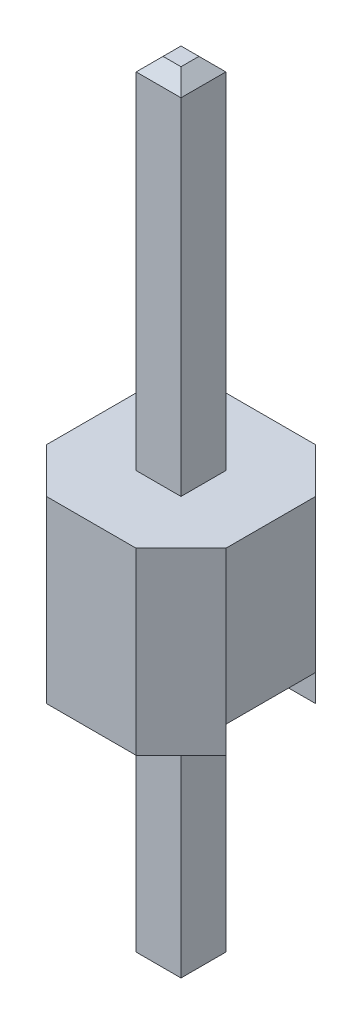
ISO-10303-21;
HEADER;
FILE_DESCRIPTION(('STEP AP214'),'2;1');
FILE_NAME('part.step','',(''),(''),'','','');
FILE_SCHEMA(('AUTOMOTIVE_DESIGN { 1 0 10303 214 1 1 1 1 }'));
ENDSEC;
DATA;
#1=APPLICATION_CONTEXT('core data for automotive mechanical design processes');
#2=APPLICATION_PROTOCOL_DEFINITION('international standard','automotive_design',2000,#1);
#3=PRODUCT_CONTEXT('',#1,'mechanical');
#4=PRODUCT('Part','Part','',(#3));
#5=PRODUCT_RELATED_PRODUCT_CATEGORY('part','',(#4));
#6=PRODUCT_DEFINITION_FORMATION('','',#4);
#7=PRODUCT_DEFINITION_CONTEXT('part definition',#1,'design');
#8=PRODUCT_DEFINITION('design','',#6,#7);
#9=PRODUCT_DEFINITION_SHAPE('','',#8);
#10=(LENGTH_UNIT() NAMED_UNIT(*) SI_UNIT(.MILLI.,.METRE.));
#11=(NAMED_UNIT(*) PLANE_ANGLE_UNIT() SI_UNIT($,.RADIAN.));
#12=(NAMED_UNIT(*) SI_UNIT($,.STERADIAN.) SOLID_ANGLE_UNIT());
#13=UNCERTAINTY_MEASURE_WITH_UNIT(LENGTH_MEASURE(1.E-05),#10,'distance_accuracy_value','');
#14=(GEOMETRIC_REPRESENTATION_CONTEXT(3) GLOBAL_UNCERTAINTY_ASSIGNED_CONTEXT((#13)) GLOBAL_UNIT_ASSIGNED_CONTEXT((#10,
#11,#12)) REPRESENTATION_CONTEXT('',''));
#15=CARTESIAN_POINT('',(0.,0.,0.));
#16=DIRECTION('',(0.,0.,1.));
#17=DIRECTION('',(1.,0.,0.));
#18=AXIS2_PLACEMENT_3D('',#15,#16,#17);
#19=CARTESIAN_POINT('',(-2.59591892663164,0.381,0.634999999999996));
#20=DIRECTION('',(0.,1.,0.));
#21=DIRECTION('',(0.,0.,1.));
#22=AXIS2_PLACEMENT_3D('',#19,#20,#21);
#23=PLANE('',#22);
#24=DIRECTION('',(0.,0.,-1.));
#25=VECTOR('',#24,1.);
#26=CARTESIAN_POINT('',(-1.27,0.381,0.635000000000008));
#27=LINE('',#26,#25);
#28=CARTESIAN_POINT('',(-1.27,0.381,0.634999999999998));
#29=VERTEX_POINT('',#28);
#30=CARTESIAN_POINT('',(-1.26999999999999,0.381,-0.635000000000004));
#31=VERTEX_POINT('',#30);
#32=EDGE_CURVE('E241',#29,#31,#27,.T.);
#33=ORIENTED_EDGE('',*,*,#32,.T.);
#34=DIRECTION('',(1.,0.,0.));
#35=VECTOR('',#34,1.);
#36=CARTESIAN_POINT('',(-2.59591892663164,0.381,-0.635000000000004));
#37=LINE('',#36,#35);
#38=CARTESIAN_POINT('',(1.27,0.381,-0.634999999999998));
#39=VERTEX_POINT('',#38);
#40=EDGE_CURVE('E249',#31,#39,#37,.T.);
#41=ORIENTED_EDGE('',*,*,#40,.T.);
#42=DIRECTION('',(0.,0.,1.));
#43=VECTOR('',#42,1.);
#44=CARTESIAN_POINT('',(1.27,0.381,0.635000000000002));
#45=LINE('',#44,#43);
#46=CARTESIAN_POINT('',(1.27,0.381,0.635000000000002));
#47=VERTEX_POINT('',#46);
#48=EDGE_CURVE('E244',#39,#47,#45,.T.);
#49=ORIENTED_EDGE('',*,*,#48,.T.);
#50=DIRECTION('',(1.,0.,0.));
#51=VECTOR('',#50,1.);
#52=CARTESIAN_POINT('',(-2.59591892663164,0.381,0.634999999999996));
#53=LINE('',#52,#51);
#54=EDGE_CURVE('E254',#29,#47,#53,.T.);
#55=ORIENTED_EDGE('',*,*,#54,.F.);
#56=EDGE_LOOP('',(#33,#41,#49,#55));
#57=FACE_BOUND('',#56,.T.);
#58=DIRECTION('',(0.,0.,1.));
#59=VECTOR('',#58,1.);
#60=CARTESIAN_POINT('',(0.3175,0.381,-0.3175));
#61=LINE('',#60,#59);
#62=CARTESIAN_POINT('',(0.3175,0.381,-0.3175));
#63=VERTEX_POINT('',#62);
#64=CARTESIAN_POINT('',(0.3175,0.381,0.3175));
#65=VERTEX_POINT('',#64);
#66=EDGE_CURVE('E186',#63,#65,#61,.T.);
#67=ORIENTED_EDGE('',*,*,#66,.F.);
#68=DIRECTION('',(1.,0.,0.));
#69=VECTOR('',#68,1.);
#70=CARTESIAN_POINT('',(-0.3175,0.381,-0.3175));
#71=LINE('',#70,#69);
#72=CARTESIAN_POINT('',(-0.3175,0.381,-0.3175));
#73=VERTEX_POINT('',#72);
#74=EDGE_CURVE('E191',#73,#63,#71,.T.);
#75=ORIENTED_EDGE('',*,*,#74,.F.);
#76=DIRECTION('',(0.,0.,-1.));
#77=VECTOR('',#76,1.);
#78=CARTESIAN_POINT('',(-0.3175,0.381,-0.3175));
#79=LINE('',#78,#77);
#80=CARTESIAN_POINT('',(-0.3175,0.381,0.3175));
#81=VERTEX_POINT('',#80);
#82=EDGE_CURVE('E203',#81,#73,#79,.T.);
#83=ORIENTED_EDGE('',*,*,#82,.F.);
#84=DIRECTION('',(-1.,0.,0.));
#85=VECTOR('',#84,1.);
#86=CARTESIAN_POINT('',(-0.3175,0.381,0.3175));
#87=LINE('',#86,#85);
#88=EDGE_CURVE('E199',#65,#81,#87,.T.);
#89=ORIENTED_EDGE('',*,*,#88,.F.);
#90=EDGE_LOOP('',(#67,#75,#83,#89));
#91=FACE_BOUND('',#90,.T.);
#92=ADVANCED_FACE('F36',(#57,#91),#23,.F.);
#93=CARTESIAN_POINT('',(0.,2.54,0.));
#94=DIRECTION('',(0.,1.,0.));
#95=DIRECTION('',(0.,0.,1.));
#96=AXIS2_PLACEMENT_3D('',#93,#94,#95);
#97=PLANE('',#96);
#98=DIRECTION('',(-1.,0.,0.));
#99=VECTOR('',#98,1.);
#100=CARTESIAN_POINT('',(-0.634999999999986,2.54,-1.27000000000001));
#101=LINE('',#100,#99);
#102=CARTESIAN_POINT('',(0.634999999999999,2.54,-1.27));
#103=VERTEX_POINT('',#102);
#104=CARTESIAN_POINT('',(-0.634999999999986,2.54,-1.27000000000001));
#105=VERTEX_POINT('',#104);
#106=EDGE_CURVE('E259',#103,#105,#101,.T.);
#107=ORIENTED_EDGE('',*,*,#106,.T.);
#108=DIRECTION('',(-0.707106781186555,0.,0.70710678118654));
#109=VECTOR('',#108,1.);
#110=CARTESIAN_POINT('',(-1.26999999999999,2.54,-0.635000000000013));
#111=LINE('',#110,#109);
#112=CARTESIAN_POINT('',(-1.26999999999999,2.54,-0.635000000000013));
#113=VERTEX_POINT('',#112);
#114=EDGE_CURVE('E262',#105,#113,#111,.T.);
#115=ORIENTED_EDGE('',*,*,#114,.T.);
#116=DIRECTION('',(0.,0.,1.));
#117=VECTOR('',#116,1.);
#118=CARTESIAN_POINT('',(-1.27,2.54,0.63499999999999));
#119=LINE('',#118,#117);
#120=CARTESIAN_POINT('',(-1.27,2.54,0.63499999999999));
#121=VERTEX_POINT('',#120);
#122=EDGE_CURVE('E265',#113,#121,#119,.T.);
#123=ORIENTED_EDGE('',*,*,#122,.T.);
#124=DIRECTION('',(0.707106781186542,0.,0.707106781186553));
#125=VECTOR('',#124,1.);
#126=CARTESIAN_POINT('',(-0.635000000000008,2.54,1.27));
#127=LINE('',#126,#125);
#128=CARTESIAN_POINT('',(-0.635000000000008,2.54,1.27));
#129=VERTEX_POINT('',#128);
#130=EDGE_CURVE('E267',#121,#129,#127,.T.);
#131=ORIENTED_EDGE('',*,*,#130,.T.);
#132=DIRECTION('',(1.,0.,0.));
#133=VECTOR('',#132,1.);
#134=CARTESIAN_POINT('',(-0.635000000000008,2.54,1.27));
#135=LINE('',#134,#133);
#136=CARTESIAN_POINT('',(0.634999999999995,2.54,1.27));
#137=VERTEX_POINT('',#136);
#138=EDGE_CURVE('E269',#129,#137,#135,.T.);
#139=ORIENTED_EDGE('',*,*,#138,.T.);
#140=DIRECTION('',(0.70710678118655,0.,-0.707106781186545));
#141=VECTOR('',#140,1.);
#142=CARTESIAN_POINT('',(1.27,2.54,0.635000000000004));
#143=LINE('',#142,#141);
#144=CARTESIAN_POINT('',(1.27,2.54,0.635000000000004));
#145=VERTEX_POINT('',#144);
#146=EDGE_CURVE('E271',#137,#145,#143,.T.);
#147=ORIENTED_EDGE('',*,*,#146,.T.);
#148=DIRECTION('',(0.,0.,-1.));
#149=VECTOR('',#148,1.);
#150=CARTESIAN_POINT('',(1.27,2.54,0.635000000000004));
#151=LINE('',#150,#149);
#152=CARTESIAN_POINT('',(1.27,2.54,-0.634999999999999));
#153=VERTEX_POINT('',#152);
#154=EDGE_CURVE('E273',#145,#153,#151,.T.);
#155=ORIENTED_EDGE('',*,*,#154,.T.);
#156=DIRECTION('',(-0.707106781186548,0.,-0.707106781186548));
#157=VECTOR('',#156,1.);
#158=CARTESIAN_POINT('',(0.634999999999999,2.54,-1.27));
#159=LINE('',#158,#157);
#160=EDGE_CURVE('E275',#153,#103,#159,.T.);
#161=ORIENTED_EDGE('',*,*,#160,.T.);
#162=EDGE_LOOP('',(#107,#115,#123,#131,#139,#147,#155,#161));
#163=FACE_BOUND('',#162,.T.);
#164=DIRECTION('',(-1.,0.,0.));
#165=VECTOR('',#164,1.);
#166=CARTESIAN_POINT('',(-0.3175,2.54,-0.3175));
#167=LINE('',#166,#165);
#168=CARTESIAN_POINT('',(0.3175,2.54,-0.3175));
#169=VERTEX_POINT('',#168);
#170=CARTESIAN_POINT('',(-0.3175,2.54,-0.3175));
#171=VERTEX_POINT('',#170);
#172=EDGE_CURVE('E217',#169,#171,#167,.T.);
#173=ORIENTED_EDGE('',*,*,#172,.F.);
#174=DIRECTION('',(0.,0.,-1.));
#175=VECTOR('',#174,1.);
#176=CARTESIAN_POINT('',(0.3175,2.54,0.3175));
#177=LINE('',#176,#175);
#178=CARTESIAN_POINT('',(0.3175,2.54,0.3175));
#179=VERTEX_POINT('',#178);
#180=EDGE_CURVE('E214',#179,#169,#177,.T.);
#181=ORIENTED_EDGE('',*,*,#180,.F.);
#182=DIRECTION('',(1.,0.,0.));
#183=VECTOR('',#182,1.);
#184=CARTESIAN_POINT('',(-0.3175,2.54,0.3175));
#185=LINE('',#184,#183);
#186=CARTESIAN_POINT('',(-0.3175,2.54,0.3175));
#187=VERTEX_POINT('',#186);
#188=EDGE_CURVE('E224',#187,#179,#185,.T.);
#189=ORIENTED_EDGE('',*,*,#188,.F.);
#190=DIRECTION('',(0.,0.,1.));
#191=VECTOR('',#190,1.);
#192=CARTESIAN_POINT('',(-0.3175,2.54,0.3175));
#193=LINE('',#192,#191);
#194=EDGE_CURVE('E221',#171,#187,#193,.T.);
#195=ORIENTED_EDGE('',*,*,#194,.F.);
#196=EDGE_LOOP('',(#173,#181,#189,#195));
#197=FACE_BOUND('',#196,.T.);
#198=ADVANCED_FACE('F389',(#163,#197),#97,.T.);
#199=CARTESIAN_POINT('',(0.,0.,0.));
#200=DIRECTION('',(0.,1.,0.));
#201=DIRECTION('',(0.,0.,1.));
#202=AXIS2_PLACEMENT_3D('',#199,#200,#201);
#203=PLANE('',#202);
#204=DIRECTION('',(-0.707106781186548,0.,-0.707106781186548));
#205=VECTOR('',#204,1.);
#206=CARTESIAN_POINT('',(0.634999999999999,0.,-1.27));
#207=LINE('',#206,#205);
#208=CARTESIAN_POINT('',(1.27,0.,-0.634999999999999));
#209=VERTEX_POINT('',#208);
#210=CARTESIAN_POINT('',(0.634999999999999,0.,-1.27));
#211=VERTEX_POINT('',#210);
#212=EDGE_CURVE('E263',#209,#211,#207,.T.);
#213=ORIENTED_EDGE('',*,*,#212,.F.);
#214=DIRECTION('',(1.,0.,0.));
#215=VECTOR('',#214,1.);
#216=CARTESIAN_POINT('',(-2.59591892663164,0.,-0.635000000000005));
#217=LINE('',#216,#215);
#218=CARTESIAN_POINT('',(-1.26999999999999,0.,-0.635000000000006));
#219=VERTEX_POINT('',#218);
#220=EDGE_CURVE('E239',#219,#209,#217,.T.);
#221=ORIENTED_EDGE('',*,*,#220,.F.);
#222=DIRECTION('',(-0.707106781186555,0.,0.70710678118654));
#223=VECTOR('',#222,1.);
#224=CARTESIAN_POINT('',(-1.26999999999999,0.,-0.635000000000013));
#225=LINE('',#224,#223);
#226=CARTESIAN_POINT('',(-0.634999999999986,0.,-1.27000000000001));
#227=VERTEX_POINT('',#226);
#228=EDGE_CURVE('E280',#227,#219,#225,.T.);
#229=ORIENTED_EDGE('',*,*,#228,.F.);
#230=DIRECTION('',(-1.,0.,0.));
#231=VECTOR('',#230,1.);
#232=CARTESIAN_POINT('',(-0.634999999999986,0.,-1.27000000000001));
#233=LINE('',#232,#231);
#234=EDGE_CURVE('E258',#211,#227,#233,.T.);
#235=ORIENTED_EDGE('',*,*,#234,.F.);
#236=EDGE_LOOP('',(#213,#221,#229,#235));
#237=FACE_BOUND('',#236,.T.);
#238=ADVANCED_FACE('F395',(#237),#203,.F.);
#239=CARTESIAN_POINT('',(-0.634999999999986,2.54,-1.27000000000001));
#240=DIRECTION('',(0.,0.,1.));
#241=DIRECTION('',(1.,0.,0.));
#242=AXIS2_PLACEMENT_3D('',#239,#240,#241);
#243=PLANE('',#242);
#244=ORIENTED_EDGE('',*,*,#234,.T.);
#245=DIRECTION('',(0.,-1.,0.));
#246=VECTOR('',#245,1.);
#247=CARTESIAN_POINT('',(-0.634999999999986,2.54,-1.27000000000001));
#248=LINE('',#247,#246);
#249=EDGE_CURVE('E311',#105,#227,#248,.T.);
#250=ORIENTED_EDGE('',*,*,#249,.F.);
#251=ORIENTED_EDGE('',*,*,#106,.F.);
#252=DIRECTION('',(0.,-1.,0.));
#253=VECTOR('',#252,1.);
#254=CARTESIAN_POINT('',(0.634999999999999,2.54,-1.27));
#255=LINE('',#254,#253);
#256=EDGE_CURVE('E277',#103,#211,#255,.T.);
#257=ORIENTED_EDGE('',*,*,#256,.T.);
#258=EDGE_LOOP('',(#244,#250,#251,#257));
#259=FACE_BOUND('',#258,.T.);
#260=ADVANCED_FACE('F437',(#259),#243,.F.);
#261=CARTESIAN_POINT('',(-1.26999999999999,2.54,-0.635000000000013));
#262=DIRECTION('',(0.70710678118654,0.,0.707106781186555));
#263=DIRECTION('',(0.707106781186555,0.,-0.70710678118654));
#264=AXIS2_PLACEMENT_3D('',#261,#262,#263);
#265=PLANE('',#264);
#266=ORIENTED_EDGE('',*,*,#228,.T.);
#267=DIRECTION('',(0.,-1.,0.));
#268=VECTOR('',#267,1.);
#269=CARTESIAN_POINT('',(-1.26999999999999,0.,-0.635000000000003));
#270=LINE('',#269,#268);
#271=EDGE_CURVE('E238',#31,#219,#270,.T.);
#272=ORIENTED_EDGE('',*,*,#271,.F.);
#273=DIRECTION('',(0.,-1.,0.));
#274=VECTOR('',#273,1.);
#275=CARTESIAN_POINT('',(-1.26999999999999,2.54,-0.635000000000013));
#276=LINE('',#275,#274);
#277=EDGE_CURVE('E308',#113,#31,#276,.T.);
#278=ORIENTED_EDGE('',*,*,#277,.F.);
#279=ORIENTED_EDGE('',*,*,#114,.F.);
#280=ORIENTED_EDGE('',*,*,#249,.T.);
#281=EDGE_LOOP('',(#266,#272,#278,#279,#280));
#282=FACE_BOUND('',#281,.T.);
#283=ADVANCED_FACE('F433',(#282),#265,.F.);
#284=CARTESIAN_POINT('',(-1.27,2.54,0.63499999999999));
#285=DIRECTION('',(1.,0.,0.));
#286=DIRECTION('',(0.,0.,-1.));
#287=AXIS2_PLACEMENT_3D('',#284,#285,#286);
#288=PLANE('',#287);
#289=ORIENTED_EDGE('',*,*,#277,.T.);
#290=ORIENTED_EDGE('',*,*,#32,.F.);
#291=DIRECTION('',(0.,-1.,0.));
#292=VECTOR('',#291,1.);
#293=CARTESIAN_POINT('',(-1.27,2.54,0.63499999999999));
#294=LINE('',#293,#292);
#295=EDGE_CURVE('E305',#121,#29,#294,.T.);
#296=ORIENTED_EDGE('',*,*,#295,.F.);
#297=ORIENTED_EDGE('',*,*,#122,.F.);
#298=EDGE_LOOP('',(#289,#290,#296,#297));
#299=FACE_BOUND('',#298,.T.);
#300=ADVANCED_FACE('F429',(#299),#288,.F.);
#301=CARTESIAN_POINT('',(-0.635000000000008,2.54,1.27));
#302=DIRECTION('',(0.707106781186553,0.,-0.707106781186542));
#303=DIRECTION('',(-0.707106781186542,0.,-0.707106781186553));
#304=AXIS2_PLACEMENT_3D('',#301,#302,#303);
#305=PLANE('',#304);
#306=DIRECTION('',(0.707106781186542,0.,0.707106781186553));
#307=VECTOR('',#306,1.);
#308=CARTESIAN_POINT('',(-0.635000000000008,0.,1.27));
#309=LINE('',#308,#307);
#310=CARTESIAN_POINT('',(-1.27,0.,0.635));
#311=VERTEX_POINT('',#310);
#312=CARTESIAN_POINT('',(-0.635000000000008,0.,1.27));
#313=VERTEX_POINT('',#312);
#314=EDGE_CURVE('E283',#311,#313,#309,.T.);
#315=ORIENTED_EDGE('',*,*,#314,.T.);
#316=DIRECTION('',(0.,-1.,0.));
#317=VECTOR('',#316,1.);
#318=CARTESIAN_POINT('',(-0.635000000000008,2.54,1.27));
#319=LINE('',#318,#317);
#320=EDGE_CURVE('E302',#129,#313,#319,.T.);
#321=ORIENTED_EDGE('',*,*,#320,.F.);
#322=ORIENTED_EDGE('',*,*,#130,.F.);
#323=ORIENTED_EDGE('',*,*,#295,.T.);
#324=DIRECTION('',(0.,1.,0.));
#325=VECTOR('',#324,1.);
#326=CARTESIAN_POINT('',(-1.27,0.,0.635));
#327=LINE('',#326,#325);
#328=EDGE_CURVE('E236',#311,#29,#327,.T.);
#329=ORIENTED_EDGE('',*,*,#328,.F.);
#330=EDGE_LOOP('',(#315,#321,#322,#323,#329));
#331=FACE_BOUND('',#330,.T.);
#332=ADVANCED_FACE('F425',(#331),#305,.F.);
#333=CARTESIAN_POINT('',(-0.635000000000008,2.54,1.27));
#334=DIRECTION('',(0.,0.,-1.));
#335=DIRECTION('',(-1.,0.,0.));
#336=AXIS2_PLACEMENT_3D('',#333,#334,#335);
#337=PLANE('',#336);
#338=DIRECTION('',(1.,0.,0.));
#339=VECTOR('',#338,1.);
#340=CARTESIAN_POINT('',(-0.635000000000008,0.,1.27));
#341=LINE('',#340,#339);
#342=CARTESIAN_POINT('',(0.634999999999995,0.,1.27));
#343=VERTEX_POINT('',#342);
#344=EDGE_CURVE('E285',#313,#343,#341,.T.);
#345=ORIENTED_EDGE('',*,*,#344,.T.);
#346=DIRECTION('',(0.,-1.,0.));
#347=VECTOR('',#346,1.);
#348=CARTESIAN_POINT('',(0.634999999999995,2.54,1.27));
#349=LINE('',#348,#347);
#350=EDGE_CURVE('E299',#137,#343,#349,.T.);
#351=ORIENTED_EDGE('',*,*,#350,.F.);
#352=ORIENTED_EDGE('',*,*,#138,.F.);
#353=ORIENTED_EDGE('',*,*,#320,.T.);
#354=EDGE_LOOP('',(#345,#351,#352,#353));
#355=FACE_BOUND('',#354,.T.);
#356=ADVANCED_FACE('F421',(#355),#337,.F.);
#357=CARTESIAN_POINT('',(1.27,2.54,0.635000000000004));
#358=DIRECTION('',(-0.707106781186545,0.,-0.70710678118655));
#359=DIRECTION('',(-0.70710678118655,0.,0.707106781186545));
#360=AXIS2_PLACEMENT_3D('',#357,#358,#359);
#361=PLANE('',#360);
#362=DIRECTION('',(0.70710678118655,0.,-0.707106781186545));
#363=VECTOR('',#362,1.);
#364=CARTESIAN_POINT('',(1.27,0.,0.635000000000004));
#365=LINE('',#364,#363);
#366=CARTESIAN_POINT('',(1.27,0.,0.635000000000004));
#367=VERTEX_POINT('',#366);
#368=EDGE_CURVE('E287',#343,#367,#365,.T.);
#369=ORIENTED_EDGE('',*,*,#368,.T.);
#370=DIRECTION('',(0.,-1.,0.));
#371=VECTOR('',#370,1.);
#372=CARTESIAN_POINT('',(1.27,0.,0.635000000000004));
#373=LINE('',#372,#371);
#374=EDGE_CURVE('E247',#47,#367,#373,.T.);
#375=ORIENTED_EDGE('',*,*,#374,.F.);
#376=DIRECTION('',(0.,-1.,0.));
#377=VECTOR('',#376,1.);
#378=CARTESIAN_POINT('',(1.27,2.54,0.635000000000004));
#379=LINE('',#378,#377);
#380=EDGE_CURVE('E296',#145,#47,#379,.T.);
#381=ORIENTED_EDGE('',*,*,#380,.F.);
#382=ORIENTED_EDGE('',*,*,#146,.F.);
#383=ORIENTED_EDGE('',*,*,#350,.T.);
#384=EDGE_LOOP('',(#369,#375,#381,#382,#383));
#385=FACE_BOUND('',#384,.T.);
#386=ADVANCED_FACE('F417',(#385),#361,.F.);
#387=CARTESIAN_POINT('',(1.27,2.54,0.635000000000004));
#388=DIRECTION('',(-1.,0.,0.));
#389=DIRECTION('',(0.,0.,1.));
#390=AXIS2_PLACEMENT_3D('',#387,#388,#389);
#391=PLANE('',#390);
#392=ORIENTED_EDGE('',*,*,#380,.T.);
#393=ORIENTED_EDGE('',*,*,#48,.F.);
#394=DIRECTION('',(0.,-1.,0.));
#395=VECTOR('',#394,1.);
#396=CARTESIAN_POINT('',(1.27,2.54,-0.634999999999999));
#397=LINE('',#396,#395);
#398=EDGE_CURVE('E293',#153,#39,#397,.T.);
#399=ORIENTED_EDGE('',*,*,#398,.F.);
#400=ORIENTED_EDGE('',*,*,#154,.F.);
#401=EDGE_LOOP('',(#392,#393,#399,#400));
#402=FACE_BOUND('',#401,.T.);
#403=ADVANCED_FACE('F413',(#402),#391,.F.);
#404=CARTESIAN_POINT('',(0.634999999999999,2.54,-1.27));
#405=DIRECTION('',(-0.707106781186548,0.,0.707106781186548));
#406=DIRECTION('',(0.707106781186548,0.,0.707106781186548));
#407=AXIS2_PLACEMENT_3D('',#404,#405,#406);
#408=PLANE('',#407);
#409=ORIENTED_EDGE('',*,*,#212,.T.);
#410=ORIENTED_EDGE('',*,*,#256,.F.);
#411=ORIENTED_EDGE('',*,*,#160,.F.);
#412=ORIENTED_EDGE('',*,*,#398,.T.);
#413=DIRECTION('',(0.,1.,0.));
#414=VECTOR('',#413,1.);
#415=CARTESIAN_POINT('',(1.27,0.,-0.634999999999999));
#416=LINE('',#415,#414);
#417=EDGE_CURVE('E235',#209,#39,#416,.T.);
#418=ORIENTED_EDGE('',*,*,#417,.F.);
#419=EDGE_LOOP('',(#409,#410,#411,#412,#418));
#420=FACE_BOUND('',#419,.T.);
#421=ADVANCED_FACE('F409',(#420),#408,.F.);
#422=ORIENTED_EDGE('',*,*,#314,.F.);
#423=DIRECTION('',(1.,0.,0.));
#424=VECTOR('',#423,1.);
#425=CARTESIAN_POINT('',(-2.59591892663164,0.,0.634999999999998));
#426=LINE('',#425,#424);
#427=EDGE_CURVE('E251',#311,#367,#426,.T.);
#428=ORIENTED_EDGE('',*,*,#427,.T.);
#429=ORIENTED_EDGE('',*,*,#368,.F.);
#430=ORIENTED_EDGE('',*,*,#344,.F.);
#431=EDGE_LOOP('',(#422,#428,#429,#430));
#432=FACE_BOUND('',#431,.T.);
#433=ADVANCED_FACE('F404',(#432),#203,.F.);
#434=CARTESIAN_POINT('',(-2.59591892663164,0.,-0.635000000000005));
#435=DIRECTION('',(0.,0.,-1.));
#436=DIRECTION('',(0.,1.,0.));
#437=AXIS2_PLACEMENT_3D('',#434,#435,#436);
#438=PLANE('',#437);
#439=ORIENTED_EDGE('',*,*,#271,.T.);
#440=ORIENTED_EDGE('',*,*,#220,.T.);
#441=ORIENTED_EDGE('',*,*,#417,.T.);
#442=ORIENTED_EDGE('',*,*,#40,.F.);
#443=EDGE_LOOP('',(#439,#440,#441,#442));
#444=FACE_BOUND('',#443,.T.);
#445=ADVANCED_FACE('F402',(#444),#438,.F.);
#446=CARTESIAN_POINT('',(-2.59591892663164,0.,0.634999999999998));
#447=DIRECTION('',(0.,0.,1.));
#448=DIRECTION('',(0.,-1.,0.));
#449=AXIS2_PLACEMENT_3D('',#446,#447,#448);
#450=PLANE('',#449);
#451=ORIENTED_EDGE('',*,*,#328,.T.);
#452=ORIENTED_EDGE('',*,*,#54,.T.);
#453=ORIENTED_EDGE('',*,*,#374,.T.);
#454=ORIENTED_EDGE('',*,*,#427,.F.);
#455=EDGE_LOOP('',(#451,#452,#453,#454));
#456=FACE_BOUND('',#455,.T.);
#457=ADVANCED_FACE('F400',(#456),#450,.F.);
#458=CARTESIAN_POINT('',(0.3175,7.62,0.3175));
#459=DIRECTION('',(-1.,0.,0.));
#460=DIRECTION('',(0.,0.,1.));
#461=AXIS2_PLACEMENT_3D('',#458,#459,#460);
#462=PLANE('',#461);
#463=DIRECTION('',(0.,-1.,0.));
#464=VECTOR('',#463,1.);
#465=CARTESIAN_POINT('',(0.3175,7.62,-0.3175));
#466=LINE('',#465,#464);
#467=CARTESIAN_POINT('',(0.3175,7.4295,-0.3175));
#468=VERTEX_POINT('',#467);
#469=EDGE_CURVE('E233',#468,#169,#466,.T.);
#470=ORIENTED_EDGE('',*,*,#469,.F.);
#471=DIRECTION('',(0.,0.,1.));
#472=VECTOR('',#471,1.);
#473=CARTESIAN_POINT('',(0.3175,7.4295,0.3175));
#474=LINE('',#473,#472);
#475=CARTESIAN_POINT('',(0.3175,7.4295,0.3175));
#476=VERTEX_POINT('',#475);
#477=EDGE_CURVE('E326',#468,#476,#474,.T.);
#478=ORIENTED_EDGE('',*,*,#477,.T.);
#479=DIRECTION('',(0.,-1.,0.));
#480=VECTOR('',#479,1.);
#481=CARTESIAN_POINT('',(0.3175,7.62,0.3175));
#482=LINE('',#481,#480);
#483=EDGE_CURVE('E227',#476,#179,#482,.T.);
#484=ORIENTED_EDGE('',*,*,#483,.T.);
#485=ORIENTED_EDGE('',*,*,#180,.T.);
#486=EDGE_LOOP('',(#470,#478,#484,#485));
#487=FACE_BOUND('',#486,.T.);
#488=ADVANCED_FACE('F526',(#487),#462,.F.);
#489=CARTESIAN_POINT('',(-0.3175,7.62,-0.3175));
#490=DIRECTION('',(0.,0.,1.));
#491=DIRECTION('',(1.,0.,0.));
#492=AXIS2_PLACEMENT_3D('',#489,#490,#491);
#493=PLANE('',#492);
#494=DIRECTION('',(0.,-1.,0.));
#495=VECTOR('',#494,1.);
#496=CARTESIAN_POINT('',(-0.3175,7.62,-0.3175));
#497=LINE('',#496,#495);
#498=CARTESIAN_POINT('',(-0.3175,7.4295,-0.3175));
#499=VERTEX_POINT('',#498);
#500=EDGE_CURVE('E231',#499,#171,#497,.T.);
#501=ORIENTED_EDGE('',*,*,#500,.F.);
#502=DIRECTION('',(1.,0.,0.));
#503=VECTOR('',#502,1.);
#504=CARTESIAN_POINT('',(-0.3175,7.4295,-0.3175));
#505=LINE('',#504,#503);
#506=EDGE_CURVE('E323',#499,#468,#505,.T.);
#507=ORIENTED_EDGE('',*,*,#506,.T.);
#508=ORIENTED_EDGE('',*,*,#469,.T.);
#509=ORIENTED_EDGE('',*,*,#172,.T.);
#510=EDGE_LOOP('',(#501,#507,#508,#509));
#511=FACE_BOUND('',#510,.T.);
#512=ADVANCED_FACE('F514',(#511),#493,.F.);
#513=CARTESIAN_POINT('',(-0.3175,7.62,0.3175));
#514=DIRECTION('',(1.,0.,0.));
#515=DIRECTION('',(0.,0.,-1.));
#516=AXIS2_PLACEMENT_3D('',#513,#514,#515);
#517=PLANE('',#516);
#518=DIRECTION('',(0.,-1.,0.));
#519=VECTOR('',#518,1.);
#520=CARTESIAN_POINT('',(-0.3175,7.62,0.3175));
#521=LINE('',#520,#519);
#522=CARTESIAN_POINT('',(-0.3175,7.4295,0.3175));
#523=VERTEX_POINT('',#522);
#524=EDGE_CURVE('E229',#523,#187,#521,.T.);
#525=ORIENTED_EDGE('',*,*,#524,.F.);
#526=DIRECTION('',(0.,0.,-1.));
#527=VECTOR('',#526,1.);
#528=CARTESIAN_POINT('',(-0.3175,7.4295,0.3175));
#529=LINE('',#528,#527);
#530=EDGE_CURVE('E328',#523,#499,#529,.T.);
#531=ORIENTED_EDGE('',*,*,#530,.T.);
#532=ORIENTED_EDGE('',*,*,#500,.T.);
#533=ORIENTED_EDGE('',*,*,#194,.T.);
#534=EDGE_LOOP('',(#525,#531,#532,#533));
#535=FACE_BOUND('',#534,.T.);
#536=ADVANCED_FACE('F508',(#535),#517,.F.);
#537=CARTESIAN_POINT('',(-0.3175,7.62,0.3175));
#538=DIRECTION('',(0.,0.,-1.));
#539=DIRECTION('',(-1.,0.,0.));
#540=AXIS2_PLACEMENT_3D('',#537,#538,#539);
#541=PLANE('',#540);
#542=ORIENTED_EDGE('',*,*,#483,.F.);
#543=DIRECTION('',(-1.,0.,0.));
#544=VECTOR('',#543,1.);
#545=CARTESIAN_POINT('',(-0.3175,7.4295,0.3175));
#546=LINE('',#545,#544);
#547=EDGE_CURVE('E330',#476,#523,#546,.T.);
#548=ORIENTED_EDGE('',*,*,#547,.T.);
#549=ORIENTED_EDGE('',*,*,#524,.T.);
#550=ORIENTED_EDGE('',*,*,#188,.T.);
#551=EDGE_LOOP('',(#542,#548,#549,#550));
#552=FACE_BOUND('',#551,.T.);
#553=ADVANCED_FACE('F513',(#552),#541,.F.);
#554=CARTESIAN_POINT('',(0.,7.62,0.));
#555=DIRECTION('',(0.,-1.,0.));
#556=DIRECTION('',(0.,0.,-1.));
#557=AXIS2_PLACEMENT_3D('',#554,#555,#556);
#558=PLANE('',#557);
#559=DIRECTION('',(0.,0.,-1.));
#560=VECTOR('',#559,1.);
#561=CARTESIAN_POINT('',(0.127000000000001,7.62,0.));
#562=LINE('',#561,#560);
#563=CARTESIAN_POINT('',(0.127000000000001,7.62,0.127000000000001));
#564=VERTEX_POINT('',#563);
#565=CARTESIAN_POINT('',(0.127000000000001,7.62,-0.127000000000001));
#566=VERTEX_POINT('',#565);
#567=EDGE_CURVE('E318',#564,#566,#562,.T.);
#568=ORIENTED_EDGE('',*,*,#567,.T.);
#569=DIRECTION('',(-1.,0.,0.));
#570=VECTOR('',#569,1.);
#571=CARTESIAN_POINT('',(0.,7.62,-0.127000000000001));
#572=LINE('',#571,#570);
#573=CARTESIAN_POINT('',(-0.127000000000001,7.62,-0.127000000000001));
#574=VERTEX_POINT('',#573);
#575=EDGE_CURVE('E320',#566,#574,#572,.T.);
#576=ORIENTED_EDGE('',*,*,#575,.T.);
#577=DIRECTION('',(0.,0.,1.));
#578=VECTOR('',#577,1.);
#579=CARTESIAN_POINT('',(-0.127000000000001,7.62,0.));
#580=LINE('',#579,#578);
#581=CARTESIAN_POINT('',(-0.127000000000001,7.62,0.127000000000001));
#582=VERTEX_POINT('',#581);
#583=EDGE_CURVE('E316',#574,#582,#580,.T.);
#584=ORIENTED_EDGE('',*,*,#583,.T.);
#585=DIRECTION('',(1.,0.,0.));
#586=VECTOR('',#585,1.);
#587=CARTESIAN_POINT('',(0.,7.62,0.127000000000001));
#588=LINE('',#587,#586);
#589=EDGE_CURVE('E314',#582,#564,#588,.T.);
#590=ORIENTED_EDGE('',*,*,#589,.T.);
#591=EDGE_LOOP('',(#568,#576,#584,#590));
#592=FACE_BOUND('',#591,.T.);
#593=ADVANCED_FACE('F457',(#592),#558,.F.);
#594=CARTESIAN_POINT('',(0.,7.62,0.127000000000001));
#595=DIRECTION('',(0.,-0.707106781186546,-0.707106781186549));
#596=DIRECTION('',(1.,0.,0.));
#597=AXIS2_PLACEMENT_3D('',#594,#595,#596);
#598=PLANE('',#597);
#599=DIRECTION('',(-0.577350269189625,-0.577350269189628,0.577350269189625));
#600=VECTOR('',#599,1.);
#601=CARTESIAN_POINT('',(-0.0846666666666676,7.66233333333333,0.0846666666666676));
#602=LINE('',#601,#600);
#603=EDGE_CURVE('E336',#523,#582,#602,.F.);
#604=ORIENTED_EDGE('',*,*,#603,.F.);
#605=ORIENTED_EDGE('',*,*,#547,.F.);
#606=DIRECTION('',(-0.577350269189625,0.577350269189628,-0.577350269189625));
#607=VECTOR('',#606,1.);
#608=CARTESIAN_POINT('',(0.0846666666666676,7.66233333333333,0.0846666666666676));
#609=LINE('',#608,#607);
#610=EDGE_CURVE('E218',#564,#476,#609,.F.);
#611=ORIENTED_EDGE('',*,*,#610,.F.);
#612=ORIENTED_EDGE('',*,*,#589,.F.);
#613=EDGE_LOOP('',(#604,#605,#611,#612));
#614=FACE_BOUND('',#613,.T.);
#615=ADVANCED_FACE('F453',(#614),#598,.F.);
#616=CARTESIAN_POINT('',(0.127000000000001,7.62,0.));
#617=DIRECTION('',(-0.707106781186549,-0.707106781186546,0.));
#618=DIRECTION('',(0.,0.,-1.));
#619=AXIS2_PLACEMENT_3D('',#616,#617,#618);
#620=PLANE('',#619);
#621=ORIENTED_EDGE('',*,*,#610,.T.);
#622=ORIENTED_EDGE('',*,*,#477,.F.);
#623=DIRECTION('',(-0.577350269189625,0.577350269189628,0.577350269189625));
#624=VECTOR('',#623,1.);
#625=CARTESIAN_POINT('',(0.0846666666666676,7.66233333333333,-0.0846666666666676));
#626=LINE('',#625,#624);
#627=EDGE_CURVE('E334',#566,#468,#626,.F.);
#628=ORIENTED_EDGE('',*,*,#627,.F.);
#629=ORIENTED_EDGE('',*,*,#567,.F.);
#630=EDGE_LOOP('',(#621,#622,#628,#629));
#631=FACE_BOUND('',#630,.T.);
#632=ADVANCED_FACE('F449',(#631),#620,.F.);
#633=CARTESIAN_POINT('',(-0.127000000000001,7.62,0.));
#634=DIRECTION('',(0.707106781186549,-0.707106781186546,0.));
#635=DIRECTION('',(0.,0.,1.));
#636=AXIS2_PLACEMENT_3D('',#633,#634,#635);
#637=PLANE('',#636);
#638=ORIENTED_EDGE('',*,*,#603,.T.);
#639=ORIENTED_EDGE('',*,*,#583,.F.);
#640=DIRECTION('',(-0.577350269189625,-0.577350269189628,-0.577350269189625));
#641=VECTOR('',#640,1.);
#642=CARTESIAN_POINT('',(-0.0846666666666676,7.66233333333333,-0.0846666666666676));
#643=LINE('',#642,#641);
#644=EDGE_CURVE('E213',#499,#574,#643,.F.);
#645=ORIENTED_EDGE('',*,*,#644,.F.);
#646=ORIENTED_EDGE('',*,*,#530,.F.);
#647=EDGE_LOOP('',(#638,#639,#645,#646));
#648=FACE_BOUND('',#647,.T.);
#649=ADVANCED_FACE('F445',(#648),#637,.F.);
#650=CARTESIAN_POINT('',(0.,7.62,-0.127000000000001));
#651=DIRECTION('',(0.,-0.707106781186546,0.707106781186549));
#652=DIRECTION('',(-1.,0.,0.));
#653=AXIS2_PLACEMENT_3D('',#650,#651,#652);
#654=PLANE('',#653);
#655=ORIENTED_EDGE('',*,*,#627,.T.);
#656=ORIENTED_EDGE('',*,*,#506,.F.);
#657=ORIENTED_EDGE('',*,*,#644,.T.);
#658=ORIENTED_EDGE('',*,*,#575,.F.);
#659=EDGE_LOOP('',(#655,#656,#657,#658));
#660=FACE_BOUND('',#659,.T.);
#661=ADVANCED_FACE('F442',(#660),#654,.F.);
#662=CARTESIAN_POINT('',(0.3175,-3.556,-0.3175));
#663=DIRECTION('',(-1.,0.,0.));
#664=DIRECTION('',(0.,0.,1.));
#665=AXIS2_PLACEMENT_3D('',#662,#663,#664);
#666=PLANE('',#665);
#667=DIRECTION('',(0.,1.,0.));
#668=VECTOR('',#667,1.);
#669=CARTESIAN_POINT('',(0.3175,-3.556,0.3175));
#670=LINE('',#669,#668);
#671=CARTESIAN_POINT('',(0.3175,-3.3655,0.3175));
#672=VERTEX_POINT('',#671);
#673=EDGE_CURVE('E211',#672,#65,#670,.T.);
#674=ORIENTED_EDGE('',*,*,#673,.F.);
#675=DIRECTION('',(0.,0.,-1.));
#676=VECTOR('',#675,1.);
#677=CARTESIAN_POINT('',(0.3175,-3.3655,-0.3175));
#678=LINE('',#677,#676);
#679=CARTESIAN_POINT('',(0.3175,-3.3655,-0.3175));
#680=VERTEX_POINT('',#679);
#681=EDGE_CURVE('E45',#672,#680,#678,.T.);
#682=ORIENTED_EDGE('',*,*,#681,.T.);
#683=DIRECTION('',(0.,1.,0.));
#684=VECTOR('',#683,1.);
#685=CARTESIAN_POINT('',(0.3175,-3.556,-0.3175));
#686=LINE('',#685,#684);
#687=EDGE_CURVE('E183',#680,#63,#686,.T.);
#688=ORIENTED_EDGE('',*,*,#687,.T.);
#689=ORIENTED_EDGE('',*,*,#66,.T.);
#690=EDGE_LOOP('',(#674,#682,#688,#689));
#691=FACE_BOUND('',#690,.T.);
#692=ADVANCED_FACE('F185',(#691),#666,.F.);
#693=CARTESIAN_POINT('',(-0.3175,-3.556,0.3175));
#694=DIRECTION('',(0.,0.,-1.));
#695=DIRECTION('',(-1.,0.,0.));
#696=AXIS2_PLACEMENT_3D('',#693,#694,#695);
#697=PLANE('',#696);
#698=DIRECTION('',(0.,1.,0.));
#699=VECTOR('',#698,1.);
#700=CARTESIAN_POINT('',(-0.3175,-3.556,0.3175));
#701=LINE('',#700,#699);
#702=CARTESIAN_POINT('',(-0.3175,-3.3655,0.3175));
#703=VERTEX_POINT('',#702);
#704=EDGE_CURVE('E209',#703,#81,#701,.T.);
#705=ORIENTED_EDGE('',*,*,#704,.F.);
#706=DIRECTION('',(1.,0.,0.));
#707=VECTOR('',#706,1.);
#708=CARTESIAN_POINT('',(-0.3175,-3.3655,0.3175));
#709=LINE('',#708,#707);
#710=EDGE_CURVE('E11',#703,#672,#709,.T.);
#711=ORIENTED_EDGE('',*,*,#710,.T.);
#712=ORIENTED_EDGE('',*,*,#673,.T.);
#713=ORIENTED_EDGE('',*,*,#88,.T.);
#714=EDGE_LOOP('',(#705,#711,#712,#713));
#715=FACE_BOUND('',#714,.T.);
#716=ADVANCED_FACE('F485',(#715),#697,.F.);
#717=CARTESIAN_POINT('',(-0.3175,-3.556,-0.3175));
#718=DIRECTION('',(1.,0.,0.));
#719=DIRECTION('',(0.,0.,-1.));
#720=AXIS2_PLACEMENT_3D('',#717,#718,#719);
#721=PLANE('',#720);
#722=DIRECTION('',(0.,1.,0.));
#723=VECTOR('',#722,1.);
#724=CARTESIAN_POINT('',(-0.3175,-3.556,-0.3175));
#725=LINE('',#724,#723);
#726=CARTESIAN_POINT('',(-0.3175,-3.3655,-0.3175));
#727=VERTEX_POINT('',#726);
#728=EDGE_CURVE('E190',#727,#73,#725,.T.);
#729=ORIENTED_EDGE('',*,*,#728,.F.);
#730=DIRECTION('',(0.,0.,1.));
#731=VECTOR('',#730,1.);
#732=CARTESIAN_POINT('',(-0.3175,-3.3655,-0.3175));
#733=LINE('',#732,#731);
#734=EDGE_CURVE('E349',#727,#703,#733,.T.);
#735=ORIENTED_EDGE('',*,*,#734,.T.);
#736=ORIENTED_EDGE('',*,*,#704,.T.);
#737=ORIENTED_EDGE('',*,*,#82,.T.);
#738=EDGE_LOOP('',(#729,#735,#736,#737));
#739=FACE_BOUND('',#738,.T.);
#740=ADVANCED_FACE('F375',(#739),#721,.F.);
#741=CARTESIAN_POINT('',(-0.3175,-3.556,-0.3175));
#742=DIRECTION('',(0.,0.,1.));
#743=DIRECTION('',(1.,0.,0.));
#744=AXIS2_PLACEMENT_3D('',#741,#742,#743);
#745=PLANE('',#744);
#746=ORIENTED_EDGE('',*,*,#687,.F.);
#747=DIRECTION('',(-1.,0.,0.));
#748=VECTOR('',#747,1.);
#749=CARTESIAN_POINT('',(-0.3175,-3.3655,-0.3175));
#750=LINE('',#749,#748);
#751=EDGE_CURVE('E352',#680,#727,#750,.T.);
#752=ORIENTED_EDGE('',*,*,#751,.T.);
#753=ORIENTED_EDGE('',*,*,#728,.T.);
#754=ORIENTED_EDGE('',*,*,#74,.T.);
#755=EDGE_LOOP('',(#746,#752,#753,#754));
#756=FACE_BOUND('',#755,.T.);
#757=ADVANCED_FACE('F201',(#756),#745,.F.);
#758=CARTESIAN_POINT('',(0.,-3.556,0.));
#759=DIRECTION('',(0.,1.,0.));
#760=DIRECTION('',(0.,0.,1.));
#761=AXIS2_PLACEMENT_3D('',#758,#759,#760);
#762=PLANE('',#761);
#763=DIRECTION('',(-1.,0.,0.));
#764=VECTOR('',#763,1.);
#765=CARTESIAN_POINT('',(0.,-3.556,0.127000000000002));
#766=LINE('',#765,#764);
#767=CARTESIAN_POINT('',(0.127000000000002,-3.556,0.127000000000002));
#768=VERTEX_POINT('',#767);
#769=CARTESIAN_POINT('',(-0.127000000000002,-3.556,0.127000000000002));
#770=VERTEX_POINT('',#769);
#771=EDGE_CURVE('E332',#768,#770,#766,.T.);
#772=ORIENTED_EDGE('',*,*,#771,.T.);
#773=DIRECTION('',(0.,0.,-1.));
#774=VECTOR('',#773,1.);
#775=CARTESIAN_POINT('',(-0.127000000000002,-3.556,0.));
#776=LINE('',#775,#774);
#777=CARTESIAN_POINT('',(-0.127000000000002,-3.556,-0.127000000000002));
#778=VERTEX_POINT('',#777);
#779=EDGE_CURVE('E346',#770,#778,#776,.T.);
#780=ORIENTED_EDGE('',*,*,#779,.T.);
#781=DIRECTION('',(1.,0.,0.));
#782=VECTOR('',#781,1.);
#783=CARTESIAN_POINT('',(0.,-3.556,-0.127000000000002));
#784=LINE('',#783,#782);
#785=CARTESIAN_POINT('',(0.127000000000002,-3.556,-0.127000000000002));
#786=VERTEX_POINT('',#785);
#787=EDGE_CURVE('E344',#778,#786,#784,.T.);
#788=ORIENTED_EDGE('',*,*,#787,.T.);
#789=DIRECTION('',(0.,0.,1.));
#790=VECTOR('',#789,1.);
#791=CARTESIAN_POINT('',(0.127000000000002,-3.556,0.));
#792=LINE('',#791,#790);
#793=EDGE_CURVE('E342',#786,#768,#792,.T.);
#794=ORIENTED_EDGE('',*,*,#793,.T.);
#795=EDGE_LOOP('',(#772,#780,#788,#794));
#796=FACE_BOUND('',#795,.T.);
#797=ADVANCED_FACE('F380',(#796),#762,.F.);
#798=CARTESIAN_POINT('',(0.127000000000002,-3.556,0.));
#799=DIRECTION('',(-0.707106781186547,0.707106781186547,0.));
#800=DIRECTION('',(0.,0.,1.));
#801=AXIS2_PLACEMENT_3D('',#798,#799,#800);
#802=PLANE('',#801);
#803=DIRECTION('',(0.577350269189626,0.577350269189626,-0.577350269189626));
#804=VECTOR('',#803,1.);
#805=CARTESIAN_POINT('',(0.0846666666666681,-3.59833333333333,-0.084666666666668));
#806=LINE('',#805,#804);
#807=EDGE_CURVE('E358',#680,#786,#806,.F.);
#808=ORIENTED_EDGE('',*,*,#807,.F.);
#809=ORIENTED_EDGE('',*,*,#681,.F.);
#810=DIRECTION('',(0.577350269189626,0.577350269189626,0.577350269189626));
#811=VECTOR('',#810,1.);
#812=CARTESIAN_POINT('',(0.084666666666668,-3.59833333333333,0.0846666666666681));
#813=LINE('',#812,#811);
#814=EDGE_CURVE('E40',#768,#672,#813,.T.);
#815=ORIENTED_EDGE('',*,*,#814,.F.);
#816=ORIENTED_EDGE('',*,*,#793,.F.);
#817=EDGE_LOOP('',(#808,#809,#815,#816));
#818=FACE_BOUND('',#817,.T.);
#819=ADVANCED_FACE('F38',(#818),#802,.F.);
#820=CARTESIAN_POINT('',(0.,-3.556,0.127000000000002));
#821=DIRECTION('',(0.,0.707106781186547,-0.707106781186547));
#822=DIRECTION('',(-1.,0.,0.));
#823=AXIS2_PLACEMENT_3D('',#820,#821,#822);
#824=PLANE('',#823);
#825=ORIENTED_EDGE('',*,*,#814,.T.);
#826=ORIENTED_EDGE('',*,*,#710,.F.);
#827=DIRECTION('',(0.577350269189626,-0.577350269189626,-0.577350269189626));
#828=VECTOR('',#827,1.);
#829=CARTESIAN_POINT('',(-0.084666666666668,-3.59833333333333,0.0846666666666681));
#830=LINE('',#829,#828);
#831=EDGE_CURVE('E357',#770,#703,#830,.F.);
#832=ORIENTED_EDGE('',*,*,#831,.F.);
#833=ORIENTED_EDGE('',*,*,#771,.F.);
#834=EDGE_LOOP('',(#825,#826,#832,#833));
#835=FACE_BOUND('',#834,.T.);
#836=ADVANCED_FACE('F367',(#835),#824,.F.);
#837=CARTESIAN_POINT('',(0.,-3.556,-0.127000000000002));
#838=DIRECTION('',(0.,0.707106781186547,0.707106781186547));
#839=DIRECTION('',(1.,0.,0.));
#840=AXIS2_PLACEMENT_3D('',#837,#838,#839);
#841=PLANE('',#840);
#842=ORIENTED_EDGE('',*,*,#807,.T.);
#843=ORIENTED_EDGE('',*,*,#787,.F.);
#844=DIRECTION('',(-0.577350269189626,0.577350269189626,-0.577350269189626));
#845=VECTOR('',#844,1.);
#846=CARTESIAN_POINT('',(-0.084666666666668,-3.59833333333333,-0.084666666666668));
#847=LINE('',#846,#845);
#848=EDGE_CURVE('E355',#727,#778,#847,.F.);
#849=ORIENTED_EDGE('',*,*,#848,.F.);
#850=ORIENTED_EDGE('',*,*,#751,.F.);
#851=EDGE_LOOP('',(#842,#843,#849,#850));
#852=FACE_BOUND('',#851,.T.);
#853=ADVANCED_FACE('F372',(#852),#841,.F.);
#854=CARTESIAN_POINT('',(-0.127000000000002,-3.556,0.));
#855=DIRECTION('',(0.707106781186547,0.707106781186547,0.));
#856=DIRECTION('',(0.,0.,-1.));
#857=AXIS2_PLACEMENT_3D('',#854,#855,#856);
#858=PLANE('',#857);
#859=ORIENTED_EDGE('',*,*,#831,.T.);
#860=ORIENTED_EDGE('',*,*,#734,.F.);
#861=ORIENTED_EDGE('',*,*,#848,.T.);
#862=ORIENTED_EDGE('',*,*,#779,.F.);
#863=EDGE_LOOP('',(#859,#860,#861,#862));
#864=FACE_BOUND('',#863,.T.);
#865=ADVANCED_FACE('F377',(#864),#858,.F.);
#866=CLOSED_SHELL('',(#92,#198,#238,#260,#283,#300,#332,#356,#386,#403,#421,#433,#445,#457,#488,
#512,#536,#553,#593,#615,#632,#649,#661,#692,#716,#740,#757,#797,#819,#836,#853,#865));
#867=MANIFOLD_SOLID_BREP('B2',#866);
#868=ADVANCED_BREP_SHAPE_REPRESENTATION('',(#18,#867),#14);
#869=SHAPE_DEFINITION_REPRESENTATION(#9,#868);
ENDSEC;
END-ISO-10303-21;
